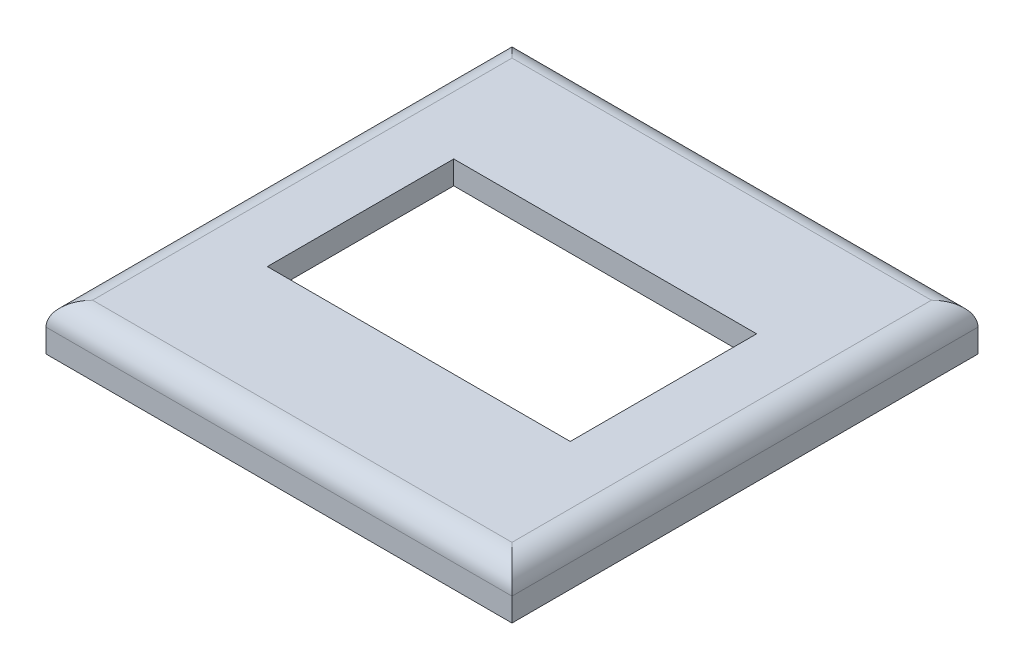
ISO-10303-21;
HEADER;
FILE_DESCRIPTION(('STEP AP214'),'2;1');
FILE_NAME('part.step','',(''),(''),'','','');
FILE_SCHEMA(('AUTOMOTIVE_DESIGN { 1 0 10303 214 1 1 1 1 }'));
ENDSEC;
DATA;
#1=APPLICATION_CONTEXT('core data for automotive mechanical design processes');
#2=APPLICATION_PROTOCOL_DEFINITION('international standard','automotive_design',2000,#1);
#3=PRODUCT_CONTEXT('',#1,'mechanical');
#4=PRODUCT('Part','Part','',(#3));
#5=PRODUCT_RELATED_PRODUCT_CATEGORY('part','',(#4));
#6=PRODUCT_DEFINITION_FORMATION('','',#4);
#7=PRODUCT_DEFINITION_CONTEXT('part definition',#1,'design');
#8=PRODUCT_DEFINITION('design','',#6,#7);
#9=PRODUCT_DEFINITION_SHAPE('','',#8);
#10=(LENGTH_UNIT() NAMED_UNIT(*) SI_UNIT(.MILLI.,.METRE.));
#11=(NAMED_UNIT(*) PLANE_ANGLE_UNIT() SI_UNIT($,.RADIAN.));
#12=(NAMED_UNIT(*) SI_UNIT($,.STERADIAN.) SOLID_ANGLE_UNIT());
#13=UNCERTAINTY_MEASURE_WITH_UNIT(LENGTH_MEASURE(1.E-05),#10,'distance_accuracy_value','');
#14=(GEOMETRIC_REPRESENTATION_CONTEXT(3) GLOBAL_UNCERTAINTY_ASSIGNED_CONTEXT((#13)) GLOBAL_UNIT_ASSIGNED_CONTEXT((#10,
#11,#12)) REPRESENTATION_CONTEXT('',''));
#15=CARTESIAN_POINT('',(0.,0.,0.));
#16=DIRECTION('',(0.,0.,1.));
#17=DIRECTION('',(1.,0.,0.));
#18=AXIS2_PLACEMENT_3D('',#15,#16,#17);
#19=CARTESIAN_POINT('',(0.,0.,0.));
#20=DIRECTION('',(0.,-1.,0.));
#21=DIRECTION('',(0.,0.,-1.));
#22=AXIS2_PLACEMENT_3D('',#19,#20,#21);
#23=PLANE('',#22);
#24=DIRECTION('',(0.,0.,1.));
#25=VECTOR('',#24,1.);
#26=CARTESIAN_POINT('',(0.,0.,0.));
#27=LINE('',#26,#25);
#28=CARTESIAN_POINT('',(0.,0.,-40.));
#29=VERTEX_POINT('',#28);
#30=CARTESIAN_POINT('',(0.,0.,0.));
#31=VERTEX_POINT('',#30);
#32=EDGE_CURVE('E219',#29,#31,#27,.T.);
#33=ORIENTED_EDGE('',*,*,#32,.F.);
#34=DIRECTION('',(-1.,0.,0.));
#35=VECTOR('',#34,1.);
#36=CARTESIAN_POINT('',(0.,0.,-40.));
#37=LINE('',#36,#35);
#38=CARTESIAN_POINT('',(40.,0.,-40.));
#39=VERTEX_POINT('',#38);
#40=EDGE_CURVE('E232',#39,#29,#37,.T.);
#41=ORIENTED_EDGE('',*,*,#40,.F.);
#42=DIRECTION('',(0.,0.,-1.));
#43=VECTOR('',#42,1.);
#44=CARTESIAN_POINT('',(40.,0.,0.));
#45=LINE('',#44,#43);
#46=CARTESIAN_POINT('',(40.,0.,0.));
#47=VERTEX_POINT('',#46);
#48=EDGE_CURVE('E228',#47,#39,#45,.T.);
#49=ORIENTED_EDGE('',*,*,#48,.F.);
#50=DIRECTION('',(1.,0.,0.));
#51=VECTOR('',#50,1.);
#52=CARTESIAN_POINT('',(0.,0.,0.));
#53=LINE('',#52,#51);
#54=EDGE_CURVE('E223',#31,#47,#53,.T.);
#55=ORIENTED_EDGE('',*,*,#54,.F.);
#56=EDGE_LOOP('',(#33,#41,#49,#55));
#57=FACE_BOUND('',#56,.T.);
#58=DIRECTION('',(-1.,0.,0.));
#59=VECTOR('',#58,1.);
#60=CARTESIAN_POINT('',(0.,0.,-38.));
#61=LINE('',#60,#59);
#62=CARTESIAN_POINT('',(38.,0.,-38.));
#63=VERTEX_POINT('',#62);
#64=CARTESIAN_POINT('',(2.,0.,-38.));
#65=VERTEX_POINT('',#64);
#66=EDGE_CURVE('E187',#63,#65,#61,.T.);
#67=ORIENTED_EDGE('',*,*,#66,.T.);
#68=DIRECTION('',(0.,0.,1.));
#69=VECTOR('',#68,1.);
#70=CARTESIAN_POINT('',(2.,0.,0.));
#71=LINE('',#70,#69);
#72=CARTESIAN_POINT('',(2.,0.,-2.));
#73=VERTEX_POINT('',#72);
#74=EDGE_CURVE('E170',#65,#73,#71,.T.);
#75=ORIENTED_EDGE('',*,*,#74,.T.);
#76=DIRECTION('',(1.,0.,0.));
#77=VECTOR('',#76,1.);
#78=CARTESIAN_POINT('',(0.,0.,-2.));
#79=LINE('',#78,#77);
#80=CARTESIAN_POINT('',(38.,0.,-2.));
#81=VERTEX_POINT('',#80);
#82=EDGE_CURVE('E208',#73,#81,#79,.T.);
#83=ORIENTED_EDGE('',*,*,#82,.T.);
#84=DIRECTION('',(0.,0.,-1.));
#85=VECTOR('',#84,1.);
#86=CARTESIAN_POINT('',(38.,0.,0.));
#87=LINE('',#86,#85);
#88=EDGE_CURVE('E212',#81,#63,#87,.T.);
#89=ORIENTED_EDGE('',*,*,#88,.T.);
#90=EDGE_LOOP('',(#67,#75,#83,#89));
#91=FACE_BOUND('',#90,.T.);
#92=ADVANCED_FACE('F38',(#57,#91),#23,.T.);
#93=CARTESIAN_POINT('',(0.,4.,0.));
#94=DIRECTION('',(1.,0.,0.));
#95=DIRECTION('',(0.,0.,-1.));
#96=AXIS2_PLACEMENT_3D('',#93,#94,#95);
#97=PLANE('',#96);
#98=DIRECTION('',(0.,-1.,0.));
#99=VECTOR('',#98,1.);
#100=CARTESIAN_POINT('',(0.,4.,0.));
#101=LINE('',#100,#99);
#102=CARTESIAN_POINT('',(0.,2.,0.));
#103=VERTEX_POINT('',#102);
#104=EDGE_CURVE('E245',#103,#31,#101,.T.);
#105=ORIENTED_EDGE('',*,*,#104,.F.);
#106=DIRECTION('',(0.,0.,1.));
#107=VECTOR('',#106,1.);
#108=CARTESIAN_POINT('',(0.,2.,0.));
#109=LINE('',#108,#107);
#110=CARTESIAN_POINT('',(0.,2.,-40.));
#111=VERTEX_POINT('',#110);
#112=EDGE_CURVE('E271',#103,#111,#109,.F.);
#113=ORIENTED_EDGE('',*,*,#112,.T.);
#114=DIRECTION('',(0.,-1.,0.));
#115=VECTOR('',#114,1.);
#116=CARTESIAN_POINT('',(0.,4.,-40.));
#117=LINE('',#116,#115);
#118=EDGE_CURVE('E236',#111,#29,#117,.T.);
#119=ORIENTED_EDGE('',*,*,#118,.T.);
#120=ORIENTED_EDGE('',*,*,#32,.T.);
#121=EDGE_LOOP('',(#105,#113,#119,#120));
#122=FACE_BOUND('',#121,.T.);
#123=ADVANCED_FACE('F314',(#122),#97,.F.);
#124=CARTESIAN_POINT('',(0.,4.,0.));
#125=DIRECTION('',(0.,0.,-1.));
#126=DIRECTION('',(-1.,0.,0.));
#127=AXIS2_PLACEMENT_3D('',#124,#125,#126);
#128=PLANE('',#127);
#129=DIRECTION('',(0.,-1.,0.));
#130=VECTOR('',#129,1.);
#131=CARTESIAN_POINT('',(40.,4.,0.));
#132=LINE('',#131,#130);
#133=CARTESIAN_POINT('',(40.,2.,0.));
#134=VERTEX_POINT('',#133);
#135=EDGE_CURVE('E242',#134,#47,#132,.T.);
#136=ORIENTED_EDGE('',*,*,#135,.F.);
#137=DIRECTION('',(1.,0.,0.));
#138=VECTOR('',#137,1.);
#139=CARTESIAN_POINT('',(0.,2.,0.));
#140=LINE('',#139,#138);
#141=EDGE_CURVE('E268',#134,#103,#140,.F.);
#142=ORIENTED_EDGE('',*,*,#141,.T.);
#143=ORIENTED_EDGE('',*,*,#104,.T.);
#144=ORIENTED_EDGE('',*,*,#54,.T.);
#145=EDGE_LOOP('',(#136,#142,#143,#144));
#146=FACE_BOUND('',#145,.T.);
#147=ADVANCED_FACE('F322',(#146),#128,.F.);
#148=CARTESIAN_POINT('',(40.,4.,0.));
#149=DIRECTION('',(-1.,0.,0.));
#150=DIRECTION('',(0.,0.,1.));
#151=AXIS2_PLACEMENT_3D('',#148,#149,#150);
#152=PLANE('',#151);
#153=DIRECTION('',(0.,-1.,0.));
#154=VECTOR('',#153,1.);
#155=CARTESIAN_POINT('',(40.,4.,-40.));
#156=LINE('',#155,#154);
#157=CARTESIAN_POINT('',(40.,2.,-40.));
#158=VERTEX_POINT('',#157);
#159=EDGE_CURVE('E239',#158,#39,#156,.T.);
#160=ORIENTED_EDGE('',*,*,#159,.F.);
#161=DIRECTION('',(0.,0.,-1.));
#162=VECTOR('',#161,1.);
#163=CARTESIAN_POINT('',(40.,2.,0.));
#164=LINE('',#163,#162);
#165=EDGE_CURVE('E265',#158,#134,#164,.F.);
#166=ORIENTED_EDGE('',*,*,#165,.T.);
#167=ORIENTED_EDGE('',*,*,#135,.T.);
#168=ORIENTED_EDGE('',*,*,#48,.T.);
#169=EDGE_LOOP('',(#160,#166,#167,#168));
#170=FACE_BOUND('',#169,.T.);
#171=ADVANCED_FACE('F332',(#170),#152,.F.);
#172=CARTESIAN_POINT('',(0.,4.,-40.));
#173=DIRECTION('',(0.,0.,1.));
#174=DIRECTION('',(1.,0.,0.));
#175=AXIS2_PLACEMENT_3D('',#172,#173,#174);
#176=PLANE('',#175);
#177=ORIENTED_EDGE('',*,*,#118,.F.);
#178=DIRECTION('',(-1.,0.,0.));
#179=VECTOR('',#178,1.);
#180=CARTESIAN_POINT('',(0.,2.,-40.));
#181=LINE('',#180,#179);
#182=EDGE_CURVE('E261',#111,#158,#181,.F.);
#183=ORIENTED_EDGE('',*,*,#182,.T.);
#184=ORIENTED_EDGE('',*,*,#159,.T.);
#185=ORIENTED_EDGE('',*,*,#40,.T.);
#186=EDGE_LOOP('',(#177,#183,#184,#185));
#187=FACE_BOUND('',#186,.T.);
#188=ADVANCED_FACE('F329',(#187),#176,.F.);
#189=CARTESIAN_POINT('',(0.,4.,0.));
#190=DIRECTION('',(0.,-1.,0.));
#191=DIRECTION('',(0.,0.,-1.));
#192=AXIS2_PLACEMENT_3D('',#189,#190,#191);
#193=PLANE('',#192);
#194=DIRECTION('',(1.,0.,0.));
#195=VECTOR('',#194,1.);
#196=CARTESIAN_POINT('',(7.00000000000001,4.,-12.));
#197=LINE('',#196,#195);
#198=CARTESIAN_POINT('',(7.00000000000001,4.,-12.));
#199=VERTEX_POINT('',#198);
#200=CARTESIAN_POINT('',(33.,4.,-12.));
#201=VERTEX_POINT('',#200);
#202=EDGE_CURVE('E152',#199,#201,#197,.T.);
#203=ORIENTED_EDGE('',*,*,#202,.F.);
#204=DIRECTION('',(0.,0.,1.));
#205=VECTOR('',#204,1.);
#206=CARTESIAN_POINT('',(7.00000000000001,4.,-28.));
#207=LINE('',#206,#205);
#208=CARTESIAN_POINT('',(7.00000000000001,4.,-28.));
#209=VERTEX_POINT('',#208);
#210=EDGE_CURVE('E54',#209,#199,#207,.T.);
#211=ORIENTED_EDGE('',*,*,#210,.F.);
#212=DIRECTION('',(-1.,0.,0.));
#213=VECTOR('',#212,1.);
#214=CARTESIAN_POINT('',(7.00000000000001,4.,-28.));
#215=LINE('',#214,#213);
#216=CARTESIAN_POINT('',(33.,4.,-28.));
#217=VERTEX_POINT('',#216);
#218=EDGE_CURVE('E160',#217,#209,#215,.T.);
#219=ORIENTED_EDGE('',*,*,#218,.F.);
#220=DIRECTION('',(0.,0.,-1.));
#221=VECTOR('',#220,1.);
#222=CARTESIAN_POINT('',(33.,4.,-28.));
#223=LINE('',#222,#221);
#224=EDGE_CURVE('E142',#201,#217,#223,.T.);
#225=ORIENTED_EDGE('',*,*,#224,.F.);
#226=EDGE_LOOP('',(#203,#211,#219,#225));
#227=FACE_BOUND('',#226,.T.);
#228=DIRECTION('',(0.,0.,-1.));
#229=VECTOR('',#228,1.);
#230=CARTESIAN_POINT('',(38.,4.,0.));
#231=LINE('',#230,#229);
#232=CARTESIAN_POINT('',(38.,4.,-2.));
#233=VERTEX_POINT('',#232);
#234=CARTESIAN_POINT('',(38.,4.,-38.));
#235=VERTEX_POINT('',#234);
#236=EDGE_CURVE('E254',#233,#235,#231,.T.);
#237=ORIENTED_EDGE('',*,*,#236,.T.);
#238=DIRECTION('',(-1.,0.,0.));
#239=VECTOR('',#238,1.);
#240=CARTESIAN_POINT('',(0.,4.,-38.));
#241=LINE('',#240,#239);
#242=CARTESIAN_POINT('',(2.,4.,-38.));
#243=VERTEX_POINT('',#242);
#244=EDGE_CURVE('E257',#235,#243,#241,.T.);
#245=ORIENTED_EDGE('',*,*,#244,.T.);
#246=DIRECTION('',(0.,0.,1.));
#247=VECTOR('',#246,1.);
#248=CARTESIAN_POINT('',(2.,4.,0.));
#249=LINE('',#248,#247);
#250=CARTESIAN_POINT('',(2.,4.,-2.));
#251=VERTEX_POINT('',#250);
#252=EDGE_CURVE('E248',#243,#251,#249,.T.);
#253=ORIENTED_EDGE('',*,*,#252,.T.);
#254=DIRECTION('',(1.,0.,0.));
#255=VECTOR('',#254,1.);
#256=CARTESIAN_POINT('',(0.,4.,-2.));
#257=LINE('',#256,#255);
#258=EDGE_CURVE('E251',#251,#233,#257,.T.);
#259=ORIENTED_EDGE('',*,*,#258,.T.);
#260=EDGE_LOOP('',(#237,#245,#253,#259));
#261=FACE_BOUND('',#260,.T.);
#262=ADVANCED_FACE('F157',(#227,#261),#193,.F.);
#263=CARTESIAN_POINT('',(0.,2.,-2.));
#264=DIRECTION('',(1.,0.,0.));
#265=DIRECTION('',(0.,0.,-1.));
#266=AXIS2_PLACEMENT_3D('',#263,#264,#265);
#267=CYLINDRICAL_SURFACE('',#266,2.);
#268=CARTESIAN_POINT('',(2.,2.,-2.));
#269=DIRECTION('',(0.707106781186547,0.,0.707106781186547));
#270=DIRECTION('',(-0.707106781186547,0.,0.707106781186547));
#271=AXIS2_PLACEMENT_3D('',#268,#269,#270);
#272=ELLIPSE('',#271,2.82842712474619,2.);
#273=EDGE_CURVE('E280',#103,#251,#272,.F.);
#274=ORIENTED_EDGE('',*,*,#273,.F.);
#275=ORIENTED_EDGE('',*,*,#141,.F.);
#276=CARTESIAN_POINT('',(38.,2.,-2.));
#277=DIRECTION('',(0.707106781186547,0.,-0.707106781186547));
#278=DIRECTION('',(0.707106781186547,0.,0.707106781186547));
#279=AXIS2_PLACEMENT_3D('',#276,#277,#278);
#280=ELLIPSE('',#279,2.82842712474619,2.);
#281=EDGE_CURVE('E224',#233,#134,#280,.T.);
#282=ORIENTED_EDGE('',*,*,#281,.F.);
#283=ORIENTED_EDGE('',*,*,#258,.F.);
#284=EDGE_LOOP('',(#274,#275,#282,#283));
#285=FACE_BOUND('',#284,.T.);
#286=ADVANCED_FACE('F40',(#285),#267,.T.);
#287=CARTESIAN_POINT('',(38.,2.,0.));
#288=DIRECTION('',(0.,0.,-1.));
#289=DIRECTION('',(-1.,0.,0.));
#290=AXIS2_PLACEMENT_3D('',#287,#288,#289);
#291=CYLINDRICAL_SURFACE('',#290,2.);
#292=ORIENTED_EDGE('',*,*,#281,.T.);
#293=ORIENTED_EDGE('',*,*,#165,.F.);
#294=CARTESIAN_POINT('',(38.,2.,-38.));
#295=DIRECTION('',(-0.707106781186547,0.,-0.707106781186547));
#296=DIRECTION('',(0.707106781186547,0.,-0.707106781186547));
#297=AXIS2_PLACEMENT_3D('',#294,#295,#296);
#298=ELLIPSE('',#297,2.82842712474619,2.);
#299=EDGE_CURVE('E277',#235,#158,#298,.T.);
#300=ORIENTED_EDGE('',*,*,#299,.F.);
#301=ORIENTED_EDGE('',*,*,#236,.F.);
#302=EDGE_LOOP('',(#292,#293,#300,#301));
#303=FACE_BOUND('',#302,.T.);
#304=ADVANCED_FACE('F346',(#303),#291,.T.);
#305=CARTESIAN_POINT('',(2.,2.,0.));
#306=DIRECTION('',(0.,0.,1.));
#307=DIRECTION('',(1.,0.,0.));
#308=AXIS2_PLACEMENT_3D('',#305,#306,#307);
#309=CYLINDRICAL_SURFACE('',#308,2.);
#310=ORIENTED_EDGE('',*,*,#273,.T.);
#311=ORIENTED_EDGE('',*,*,#252,.F.);
#312=CARTESIAN_POINT('',(2.,2.,-38.));
#313=DIRECTION('',(-0.707106781186547,0.,0.707106781186547));
#314=DIRECTION('',(0.707106781186547,0.,0.707106781186547));
#315=AXIS2_PLACEMENT_3D('',#312,#313,#314);
#316=ELLIPSE('',#315,2.82842712474619,2.);
#317=EDGE_CURVE('E195',#111,#243,#316,.F.);
#318=ORIENTED_EDGE('',*,*,#317,.F.);
#319=ORIENTED_EDGE('',*,*,#112,.F.);
#320=EDGE_LOOP('',(#310,#311,#318,#319));
#321=FACE_BOUND('',#320,.T.);
#322=ADVANCED_FACE('F343',(#321),#309,.T.);
#323=CARTESIAN_POINT('',(0.,2.,-38.));
#324=DIRECTION('',(-1.,0.,0.));
#325=DIRECTION('',(0.,0.,1.));
#326=AXIS2_PLACEMENT_3D('',#323,#324,#325);
#327=CYLINDRICAL_SURFACE('',#326,2.);
#328=ORIENTED_EDGE('',*,*,#299,.T.);
#329=ORIENTED_EDGE('',*,*,#182,.F.);
#330=ORIENTED_EDGE('',*,*,#317,.T.);
#331=ORIENTED_EDGE('',*,*,#244,.F.);
#332=EDGE_LOOP('',(#328,#329,#330,#331));
#333=FACE_BOUND('',#332,.T.);
#334=ADVANCED_FACE('F340',(#333),#327,.T.);
#335=CARTESIAN_POINT('',(2.,4.,0.));
#336=DIRECTION('',(1.,0.,0.));
#337=DIRECTION('',(0.,0.,-1.));
#338=AXIS2_PLACEMENT_3D('',#335,#336,#337);
#339=PLANE('',#338);
#340=DIRECTION('',(0.,-1.,0.));
#341=VECTOR('',#340,1.);
#342=CARTESIAN_POINT('',(2.,4.,-2.));
#343=LINE('',#342,#341);
#344=CARTESIAN_POINT('',(2.,2.,-2.));
#345=VERTEX_POINT('',#344);
#346=EDGE_CURVE('E175',#345,#73,#343,.T.);
#347=ORIENTED_EDGE('',*,*,#346,.T.);
#348=ORIENTED_EDGE('',*,*,#74,.F.);
#349=DIRECTION('',(0.,-1.,0.));
#350=VECTOR('',#349,1.);
#351=CARTESIAN_POINT('',(2.,4.,-38.));
#352=LINE('',#351,#350);
#353=CARTESIAN_POINT('',(2.,2.,-38.));
#354=VERTEX_POINT('',#353);
#355=EDGE_CURVE('E183',#354,#65,#352,.T.);
#356=ORIENTED_EDGE('',*,*,#355,.F.);
#357=DIRECTION('',(0.,0.,1.));
#358=VECTOR('',#357,1.);
#359=CARTESIAN_POINT('',(2.,2.,0.));
#360=LINE('',#359,#358);
#361=EDGE_CURVE('E178',#354,#345,#360,.T.);
#362=ORIENTED_EDGE('',*,*,#361,.T.);
#363=EDGE_LOOP('',(#347,#348,#356,#362));
#364=FACE_BOUND('',#363,.T.);
#365=ADVANCED_FACE('F342',(#364),#339,.T.);
#366=CARTESIAN_POINT('',(0.,4.,-2.));
#367=DIRECTION('',(0.,0.,-1.));
#368=DIRECTION('',(-1.,0.,0.));
#369=AXIS2_PLACEMENT_3D('',#366,#367,#368);
#370=PLANE('',#369);
#371=DIRECTION('',(0.,-1.,0.));
#372=VECTOR('',#371,1.);
#373=CARTESIAN_POINT('',(38.,4.,-2.));
#374=LINE('',#373,#372);
#375=CARTESIAN_POINT('',(38.,2.,-2.));
#376=VERTEX_POINT('',#375);
#377=EDGE_CURVE('E179',#376,#81,#374,.T.);
#378=ORIENTED_EDGE('',*,*,#377,.T.);
#379=ORIENTED_EDGE('',*,*,#82,.F.);
#380=ORIENTED_EDGE('',*,*,#346,.F.);
#381=DIRECTION('',(-1.,0.,0.));
#382=VECTOR('',#381,1.);
#383=CARTESIAN_POINT('',(0.,2.,-2.));
#384=LINE('',#383,#382);
#385=EDGE_CURVE('E191',#376,#345,#384,.T.);
#386=ORIENTED_EDGE('',*,*,#385,.F.);
#387=EDGE_LOOP('',(#378,#379,#380,#386));
#388=FACE_BOUND('',#387,.T.);
#389=ADVANCED_FACE('F427',(#388),#370,.T.);
#390=CARTESIAN_POINT('',(38.,4.,0.));
#391=DIRECTION('',(-1.,0.,0.));
#392=DIRECTION('',(0.,0.,1.));
#393=AXIS2_PLACEMENT_3D('',#390,#391,#392);
#394=PLANE('',#393);
#395=DIRECTION('',(0.,-1.,0.));
#396=VECTOR('',#395,1.);
#397=CARTESIAN_POINT('',(38.,4.,-38.));
#398=LINE('',#397,#396);
#399=CARTESIAN_POINT('',(38.,2.,-38.));
#400=VERTEX_POINT('',#399);
#401=EDGE_CURVE('E186',#400,#63,#398,.T.);
#402=ORIENTED_EDGE('',*,*,#401,.T.);
#403=ORIENTED_EDGE('',*,*,#88,.F.);
#404=ORIENTED_EDGE('',*,*,#377,.F.);
#405=DIRECTION('',(0.,0.,1.));
#406=VECTOR('',#405,1.);
#407=CARTESIAN_POINT('',(38.,2.,0.));
#408=LINE('',#407,#406);
#409=EDGE_CURVE('E196',#400,#376,#408,.T.);
#410=ORIENTED_EDGE('',*,*,#409,.F.);
#411=EDGE_LOOP('',(#402,#403,#404,#410));
#412=FACE_BOUND('',#411,.T.);
#413=ADVANCED_FACE('F419',(#412),#394,.T.);
#414=CARTESIAN_POINT('',(0.,4.,-38.));
#415=DIRECTION('',(0.,0.,1.));
#416=DIRECTION('',(1.,0.,0.));
#417=AXIS2_PLACEMENT_3D('',#414,#415,#416);
#418=PLANE('',#417);
#419=ORIENTED_EDGE('',*,*,#355,.T.);
#420=ORIENTED_EDGE('',*,*,#66,.F.);
#421=ORIENTED_EDGE('',*,*,#401,.F.);
#422=DIRECTION('',(1.,0.,0.));
#423=VECTOR('',#422,1.);
#424=CARTESIAN_POINT('',(0.,2.,-38.));
#425=LINE('',#424,#423);
#426=EDGE_CURVE('E182',#354,#400,#425,.T.);
#427=ORIENTED_EDGE('',*,*,#426,.F.);
#428=EDGE_LOOP('',(#419,#420,#421,#427));
#429=FACE_BOUND('',#428,.T.);
#430=ADVANCED_FACE('F309',(#429),#418,.T.);
#431=CARTESIAN_POINT('',(0.,2.,0.));
#432=DIRECTION('',(0.,-1.,0.));
#433=DIRECTION('',(0.,0.,-1.));
#434=AXIS2_PLACEMENT_3D('',#431,#432,#433);
#435=PLANE('',#434);
#436=DIRECTION('',(0.,0.,-1.));
#437=VECTOR('',#436,1.);
#438=CARTESIAN_POINT('',(7.00000000000001,2.,0.));
#439=LINE('',#438,#437);
#440=CARTESIAN_POINT('',(7.00000000000001,2.,-12.));
#441=VERTEX_POINT('',#440);
#442=CARTESIAN_POINT('',(7.00000000000001,2.,-28.));
#443=VERTEX_POINT('',#442);
#444=EDGE_CURVE('E11',#441,#443,#439,.T.);
#445=ORIENTED_EDGE('',*,*,#444,.F.);
#446=DIRECTION('',(-1.,0.,0.));
#447=VECTOR('',#446,1.);
#448=CARTESIAN_POINT('',(0.,2.,-12.));
#449=LINE('',#448,#447);
#450=CARTESIAN_POINT('',(33.,2.,-12.));
#451=VERTEX_POINT('',#450);
#452=EDGE_CURVE('E274',#451,#441,#449,.T.);
#453=ORIENTED_EDGE('',*,*,#452,.F.);
#454=DIRECTION('',(0.,0.,1.));
#455=VECTOR('',#454,1.);
#456=CARTESIAN_POINT('',(33.,2.,0.));
#457=LINE('',#456,#455);
#458=CARTESIAN_POINT('',(33.,2.,-28.));
#459=VERTEX_POINT('',#458);
#460=EDGE_CURVE('E145',#459,#451,#457,.T.);
#461=ORIENTED_EDGE('',*,*,#460,.F.);
#462=DIRECTION('',(1.,0.,0.));
#463=VECTOR('',#462,1.);
#464=CARTESIAN_POINT('',(0.,2.,-28.));
#465=LINE('',#464,#463);
#466=EDGE_CURVE('E47',#443,#459,#465,.T.);
#467=ORIENTED_EDGE('',*,*,#466,.F.);
#468=EDGE_LOOP('',(#445,#453,#461,#467));
#469=FACE_BOUND('',#468,.T.);
#470=ORIENTED_EDGE('',*,*,#409,.T.);
#471=ORIENTED_EDGE('',*,*,#385,.T.);
#472=ORIENTED_EDGE('',*,*,#361,.F.);
#473=ORIENTED_EDGE('',*,*,#426,.T.);
#474=EDGE_LOOP('',(#470,#471,#472,#473));
#475=FACE_BOUND('',#474,.T.);
#476=ADVANCED_FACE('F297',(#469,#475),#435,.T.);
#477=CARTESIAN_POINT('',(7.00000000000001,0.,-28.));
#478=DIRECTION('',(-1.,0.,0.));
#479=DIRECTION('',(0.,0.,1.));
#480=AXIS2_PLACEMENT_3D('',#477,#478,#479);
#481=PLANE('',#480);
#482=ORIENTED_EDGE('',*,*,#444,.T.);
#483=DIRECTION('',(0.,1.,0.));
#484=VECTOR('',#483,1.);
#485=CARTESIAN_POINT('',(7.00000000000001,0.,-28.));
#486=LINE('',#485,#484);
#487=EDGE_CURVE('E167',#443,#209,#486,.T.);
#488=ORIENTED_EDGE('',*,*,#487,.T.);
#489=ORIENTED_EDGE('',*,*,#210,.T.);
#490=DIRECTION('',(0.,1.,0.));
#491=VECTOR('',#490,1.);
#492=CARTESIAN_POINT('',(7.00000000000001,0.,-12.));
#493=LINE('',#492,#491);
#494=EDGE_CURVE('E149',#441,#199,#493,.T.);
#495=ORIENTED_EDGE('',*,*,#494,.F.);
#496=EDGE_LOOP('',(#482,#488,#489,#495));
#497=FACE_BOUND('',#496,.T.);
#498=ADVANCED_FACE('F299',(#497),#481,.F.);
#499=CARTESIAN_POINT('',(7.00000000000001,0.,-28.));
#500=DIRECTION('',(0.,0.,-1.));
#501=DIRECTION('',(-1.,0.,0.));
#502=AXIS2_PLACEMENT_3D('',#499,#500,#501);
#503=PLANE('',#502);
#504=ORIENTED_EDGE('',*,*,#466,.T.);
#505=DIRECTION('',(0.,1.,0.));
#506=VECTOR('',#505,1.);
#507=CARTESIAN_POINT('',(33.,0.,-28.));
#508=LINE('',#507,#506);
#509=EDGE_CURVE('E148',#459,#217,#508,.T.);
#510=ORIENTED_EDGE('',*,*,#509,.T.);
#511=ORIENTED_EDGE('',*,*,#218,.T.);
#512=ORIENTED_EDGE('',*,*,#487,.F.);
#513=EDGE_LOOP('',(#504,#510,#511,#512));
#514=FACE_BOUND('',#513,.T.);
#515=ADVANCED_FACE('F294',(#514),#503,.F.);
#516=CARTESIAN_POINT('',(33.,0.,-28.));
#517=DIRECTION('',(1.,0.,0.));
#518=DIRECTION('',(0.,0.,-1.));
#519=AXIS2_PLACEMENT_3D('',#516,#517,#518);
#520=PLANE('',#519);
#521=ORIENTED_EDGE('',*,*,#460,.T.);
#522=DIRECTION('',(0.,1.,0.));
#523=VECTOR('',#522,1.);
#524=CARTESIAN_POINT('',(33.,0.,-12.));
#525=LINE('',#524,#523);
#526=EDGE_CURVE('E62',#451,#201,#525,.T.);
#527=ORIENTED_EDGE('',*,*,#526,.T.);
#528=ORIENTED_EDGE('',*,*,#224,.T.);
#529=ORIENTED_EDGE('',*,*,#509,.F.);
#530=EDGE_LOOP('',(#521,#527,#528,#529));
#531=FACE_BOUND('',#530,.T.);
#532=ADVANCED_FACE('F139',(#531),#520,.F.);
#533=CARTESIAN_POINT('',(7.00000000000001,0.,-12.));
#534=DIRECTION('',(0.,0.,1.));
#535=DIRECTION('',(1.,0.,0.));
#536=AXIS2_PLACEMENT_3D('',#533,#534,#535);
#537=PLANE('',#536);
#538=ORIENTED_EDGE('',*,*,#452,.T.);
#539=ORIENTED_EDGE('',*,*,#494,.T.);
#540=ORIENTED_EDGE('',*,*,#202,.T.);
#541=ORIENTED_EDGE('',*,*,#526,.F.);
#542=EDGE_LOOP('',(#538,#539,#540,#541));
#543=FACE_BOUND('',#542,.T.);
#544=ADVANCED_FACE('F153',(#543),#537,.F.);
#545=CLOSED_SHELL('',(#92,#123,#147,#171,#188,#262,#286,#304,#322,#334,#365,#389,#413,#430,#476,
#498,#515,#532,#544));
#546=MANIFOLD_SOLID_BREP('B2',#545);
#547=ADVANCED_BREP_SHAPE_REPRESENTATION('',(#18,#546),#14);
#548=SHAPE_DEFINITION_REPRESENTATION(#9,#547);
ENDSEC;
END-ISO-10303-21;
